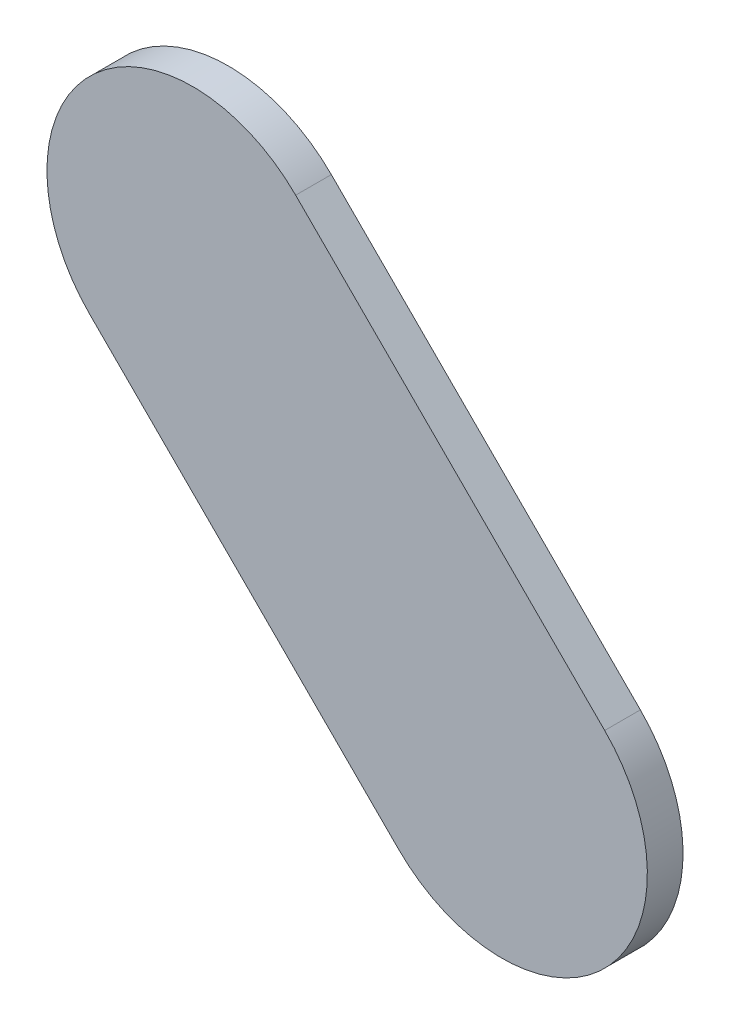
ISO-10303-21;
HEADER;
FILE_DESCRIPTION(('STEP AP214'),'2;1');
FILE_NAME('part.step','',(''),(''),'','','');
FILE_SCHEMA(('AUTOMOTIVE_DESIGN { 1 0 10303 214 1 1 1 1 }'));
ENDSEC;
DATA;
#1=APPLICATION_CONTEXT('core data for automotive mechanical design processes');
#2=APPLICATION_PROTOCOL_DEFINITION('international standard','automotive_design',2000,#1);
#3=PRODUCT_CONTEXT('',#1,'mechanical');
#4=PRODUCT('Part','Part','',(#3));
#5=PRODUCT_RELATED_PRODUCT_CATEGORY('part','',(#4));
#6=PRODUCT_DEFINITION_FORMATION('','',#4);
#7=PRODUCT_DEFINITION_CONTEXT('part definition',#1,'design');
#8=PRODUCT_DEFINITION('design','',#6,#7);
#9=PRODUCT_DEFINITION_SHAPE('','',#8);
#10=(LENGTH_UNIT() NAMED_UNIT(*) SI_UNIT(.MILLI.,.METRE.));
#11=(NAMED_UNIT(*) PLANE_ANGLE_UNIT() SI_UNIT($,.RADIAN.));
#12=(NAMED_UNIT(*) SI_UNIT($,.STERADIAN.) SOLID_ANGLE_UNIT());
#13=UNCERTAINTY_MEASURE_WITH_UNIT(LENGTH_MEASURE(1.E-05),#10,'distance_accuracy_value','');
#14=(GEOMETRIC_REPRESENTATION_CONTEXT(3) GLOBAL_UNCERTAINTY_ASSIGNED_CONTEXT((#13)) GLOBAL_UNIT_ASSIGNED_CONTEXT((#10,
#11,#12)) REPRESENTATION_CONTEXT('',''));
#15=CARTESIAN_POINT('',(0.,0.,0.));
#16=DIRECTION('',(0.,0.,1.));
#17=DIRECTION('',(1.,0.,0.));
#18=AXIS2_PLACEMENT_3D('',#15,#16,#17);
#19=CARTESIAN_POINT('',(6.483644999428,2.799554039131,0.79916));
#20=DIRECTION('',(0.,0.,1.));
#21=DIRECTION('',(1.,0.,0.));
#22=AXIS2_PLACEMENT_3D('',#19,#20,#21);
#23=PLANE('',#22);
#24=CARTESIAN_POINT('',(6.335259,2.947420434268,0.79916));
#25=DIRECTION('',(0.,0.,1.));
#26=DIRECTION('',(1.,0.,0.));
#27=AXIS2_PLACEMENT_3D('',#24,#25,#26);
#28=CIRCLE('',#27,0.140000472348);
#29=CARTESIAN_POINT('',(6.23626388883356,2.8484254441665,0.79916));
#30=VERTEX_POINT('',#29);
#31=CARTESIAN_POINT('',(6.43425436426737,3.04641563673356,0.79916));
#32=VERTEX_POINT('',#31);
#33=EDGE_CURVE('E20',#30,#32,#28,.F.);
#34=ORIENTED_EDGE('',*,*,#33,.F.);
#35=DIRECTION('',(-0.707107575236102,0.707105987136102,0.));
#36=VECTOR('',#35,1.);
#37=CARTESIAN_POINT('',(6.533249000001,2.551441000001,0.79916));
#38=LINE('',#37,#36);
#39=CARTESIAN_POINT('',(6.53324908090159,2.55144091910059,0.79916));
#40=VERTEX_POINT('',#39);
#41=EDGE_CURVE('E65',#30,#40,#38,.F.);
#42=ORIENTED_EDGE('',*,*,#41,.T.);
#43=CARTESIAN_POINT('',(6.632244,2.650435333,0.79916));
#44=DIRECTION('',(0.,0.,1.));
#45=DIRECTION('',(1.,0.,0.));
#46=AXIS2_PLACEMENT_3D('',#43,#44,#45);
#47=CIRCLE('',#46,0.140000072315);
#48=CARTESIAN_POINT('',(6.73123888933318,2.74943044466619,0.79916));
#49=VERTEX_POINT('',#48);
#50=EDGE_CURVE('E57',#49,#40,#47,.F.);
#51=ORIENTED_EDGE('',*,*,#50,.F.);
#52=DIRECTION('',(0.707105987136602,-0.707107575235602,0.));
#53=VECTOR('',#52,1.);
#54=CARTESIAN_POINT('',(6.434254334001,3.046415667,0.79916));
#55=LINE('',#54,#53);
#56=EDGE_CURVE('E64',#49,#32,#55,.F.);
#57=ORIENTED_EDGE('',*,*,#56,.T.);
#58=EDGE_LOOP('',(#34,#42,#51,#57));
#59=FACE_BOUND('',#58,.T.);
#60=ADVANCED_FACE('F17',(#59),#23,.T.);
#61=CARTESIAN_POINT('',(6.533249000001,2.551441000001,0.76487));
#62=DIRECTION('',(0.707105987136102,0.707107575236102,0.));
#63=DIRECTION('',(-0.707107575236102,0.707105987136102,0.));
#64=AXIS2_PLACEMENT_3D('',#61,#62,#63);
#65=PLANE('',#64);
#66=DIRECTION('',(0.,0.,1.));
#67=VECTOR('',#66,1.);
#68=CARTESIAN_POINT('',(6.23626400000002,2.84842533300002,0.76487));
#69=LINE('',#68,#67);
#70=CARTESIAN_POINT('',(6.23626388883345,2.84842544416632,0.76487));
#71=VERTEX_POINT('',#70);
#72=EDGE_CURVE('E68',#71,#30,#69,.T.);
#73=ORIENTED_EDGE('',*,*,#72,.F.);
#74=DIRECTION('',(-0.707107575236587,0.707105987135616,0.));
#75=VECTOR('',#74,1.);
#76=CARTESIAN_POINT('',(6.533249000001,2.551441000001,0.76487));
#77=LINE('',#76,#75);
#78=CARTESIAN_POINT('',(6.53324908090163,2.55144091910056,0.76487));
#79=VERTEX_POINT('',#78);
#80=EDGE_CURVE('E72',#79,#71,#77,.T.);
#81=ORIENTED_EDGE('',*,*,#80,.F.);
#82=DIRECTION('',(0.,0.,1.));
#83=VECTOR('',#82,1.);
#84=CARTESIAN_POINT('',(6.533249000001,2.551441000001,0.76487));
#85=LINE('',#84,#83);
#86=EDGE_CURVE('E60',#40,#79,#85,.F.);
#87=ORIENTED_EDGE('',*,*,#86,.F.);
#88=ORIENTED_EDGE('',*,*,#41,.F.);
#89=EDGE_LOOP('',(#73,#81,#87,#88));
#90=FACE_BOUND('',#89,.T.);
#91=ADVANCED_FACE('F70',(#90),#65,.F.);
#92=CARTESIAN_POINT('',(6.335259,2.947420434268,0.76487));
#93=DIRECTION('',(0.,0.,1.));
#94=DIRECTION('',(1.,0.,0.));
#95=AXIS2_PLACEMENT_3D('',#92,#93,#94);
#96=CYLINDRICAL_SURFACE('',#95,0.140000472348);
#97=DIRECTION('',(0.,0.,1.));
#98=VECTOR('',#97,1.);
#99=CARTESIAN_POINT('',(6.434254334001,3.046415667,0.76487));
#100=LINE('',#99,#98);
#101=CARTESIAN_POINT('',(6.43425436426735,3.04641563673358,0.76487));
#102=VERTEX_POINT('',#101);
#103=EDGE_CURVE('E77',#32,#102,#100,.F.);
#104=ORIENTED_EDGE('',*,*,#103,.T.);
#105=CARTESIAN_POINT('',(6.335258667,2.947420667,0.76487));
#106=DIRECTION('',(0.,0.,1.));
#107=DIRECTION('',(1.,0.,0.));
#108=AXIS2_PLACEMENT_3D('',#105,#106,#107);
#109=CIRCLE('',#108,0.140000072315);
#110=EDGE_CURVE('E26',#71,#102,#109,.F.);
#111=ORIENTED_EDGE('',*,*,#110,.F.);
#112=ORIENTED_EDGE('',*,*,#72,.T.);
#113=ORIENTED_EDGE('',*,*,#33,.T.);
#114=EDGE_LOOP('',(#104,#111,#112,#113));
#115=FACE_BOUND('',#114,.T.);
#116=ADVANCED_FACE('F88',(#115),#96,.T.);
#117=CARTESIAN_POINT('',(6.434254334001,3.046415667,0.76487));
#118=DIRECTION('',(-0.707107575235602,-0.707105987136602,0.));
#119=DIRECTION('',(0.707105987136602,-0.707107575235602,0.));
#120=AXIS2_PLACEMENT_3D('',#117,#118,#119);
#121=PLANE('',#120);
#122=DIRECTION('',(0.,0.,1.));
#123=VECTOR('',#122,1.);
#124=CARTESIAN_POINT('',(6.73123866699998,2.74943066699998,0.76487));
#125=LINE('',#124,#123);
#126=CARTESIAN_POINT('',(6.73123888933322,2.74943044466626,0.76487));
#127=VERTEX_POINT('',#126);
#128=EDGE_CURVE('E62',#127,#49,#125,.T.);
#129=ORIENTED_EDGE('',*,*,#128,.F.);
#130=DIRECTION('',(0.707105987136807,-0.707107575235397,0.));
#131=VECTOR('',#130,1.);
#132=CARTESIAN_POINT('',(6.434254334001,3.046415667,0.76487));
#133=LINE('',#132,#131);
#134=EDGE_CURVE('E11',#102,#127,#133,.T.);
#135=ORIENTED_EDGE('',*,*,#134,.F.);
#136=ORIENTED_EDGE('',*,*,#103,.F.);
#137=ORIENTED_EDGE('',*,*,#56,.F.);
#138=EDGE_LOOP('',(#129,#135,#136,#137));
#139=FACE_BOUND('',#138,.T.);
#140=ADVANCED_FACE('F96',(#139),#121,.F.);
#141=CARTESIAN_POINT('',(6.632244,2.650435333,0.76487));
#142=DIRECTION('',(0.,0.,1.));
#143=DIRECTION('',(1.,0.,0.));
#144=AXIS2_PLACEMENT_3D('',#141,#142,#143);
#145=CYLINDRICAL_SURFACE('',#144,0.140000072315);
#146=CARTESIAN_POINT('',(6.632244000001,2.650435898733,0.76487));
#147=DIRECTION('',(0.,0.,1.));
#148=DIRECTION('',(1.,0.,0.));
#149=AXIS2_PLACEMENT_3D('',#146,#147,#148);
#150=CIRCLE('',#149,0.14);
#151=EDGE_CURVE('E35',#127,#79,#150,.F.);
#152=ORIENTED_EDGE('',*,*,#151,.F.);
#153=ORIENTED_EDGE('',*,*,#128,.T.);
#154=ORIENTED_EDGE('',*,*,#50,.T.);
#155=ORIENTED_EDGE('',*,*,#86,.T.);
#156=EDGE_LOOP('',(#152,#153,#154,#155));
#157=FACE_BOUND('',#156,.T.);
#158=ADVANCED_FACE('F58',(#157),#145,.T.);
#159=CARTESIAN_POINT('',(6.483644999428,2.799554039131,0.76487));
#160=DIRECTION('',(0.,0.,-1.));
#161=DIRECTION('',(-1.,0.,0.));
#162=AXIS2_PLACEMENT_3D('',#159,#160,#161);
#163=PLANE('',#162);
#164=ORIENTED_EDGE('',*,*,#134,.T.);
#165=ORIENTED_EDGE('',*,*,#151,.T.);
#166=ORIENTED_EDGE('',*,*,#80,.T.);
#167=ORIENTED_EDGE('',*,*,#110,.T.);
#168=EDGE_LOOP('',(#164,#165,#166,#167));
#169=FACE_BOUND('',#168,.T.);
#170=ADVANCED_FACE('F89',(#169),#163,.T.);
#171=CLOSED_SHELL('',(#60,#91,#116,#140,#158,#170));
#172=MANIFOLD_SOLID_BREP('B1',#171);
#173=ADVANCED_BREP_SHAPE_REPRESENTATION('',(#18,#172),#14);
#174=SHAPE_DEFINITION_REPRESENTATION(#9,#173);
ENDSEC;
END-ISO-10303-21;
